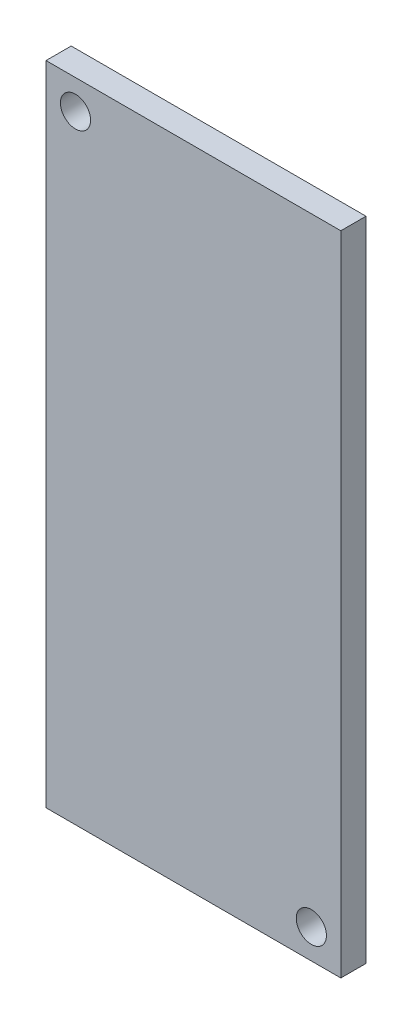
ISO-10303-21;
HEADER;
FILE_DESCRIPTION(('STEP AP214'),'2;1');
FILE_NAME('part.step','',(''),(''),'','','');
FILE_SCHEMA(('AUTOMOTIVE_DESIGN { 1 0 10303 214 1 1 1 1 }'));
ENDSEC;
DATA;
#1=APPLICATION_CONTEXT('core data for automotive mechanical design processes');
#2=APPLICATION_PROTOCOL_DEFINITION('international standard','automotive_design',2000,#1);
#3=PRODUCT_CONTEXT('',#1,'mechanical');
#4=PRODUCT('Part','Part','',(#3));
#5=PRODUCT_RELATED_PRODUCT_CATEGORY('part','',(#4));
#6=PRODUCT_DEFINITION_FORMATION('','',#4);
#7=PRODUCT_DEFINITION_CONTEXT('part definition',#1,'design');
#8=PRODUCT_DEFINITION('design','',#6,#7);
#9=PRODUCT_DEFINITION_SHAPE('','',#8);
#10=(LENGTH_UNIT() NAMED_UNIT(*) SI_UNIT(.MILLI.,.METRE.));
#11=(NAMED_UNIT(*) PLANE_ANGLE_UNIT() SI_UNIT($,.RADIAN.));
#12=(NAMED_UNIT(*) SI_UNIT($,.STERADIAN.) SOLID_ANGLE_UNIT());
#13=UNCERTAINTY_MEASURE_WITH_UNIT(LENGTH_MEASURE(1.E-05),#10,'distance_accuracy_value','');
#14=(GEOMETRIC_REPRESENTATION_CONTEXT(3) GLOBAL_UNCERTAINTY_ASSIGNED_CONTEXT((#13)) GLOBAL_UNIT_ASSIGNED_CONTEXT((#10,
#11,#12)) REPRESENTATION_CONTEXT('',''));
#15=CARTESIAN_POINT('',(0.,0.,0.));
#16=DIRECTION('',(0.,0.,1.));
#17=DIRECTION('',(1.,0.,0.));
#18=AXIS2_PLACEMENT_3D('',#15,#16,#17);
#19=CARTESIAN_POINT('',(-10.25,22.5,1.75));
#20=DIRECTION('',(1.,0.,0.));
#21=DIRECTION('',(0.,0.,-1.));
#22=AXIS2_PLACEMENT_3D('',#19,#20,#21);
#23=PLANE('',#22);
#24=DIRECTION('',(0.,-1.,0.));
#25=VECTOR('',#24,1.);
#26=CARTESIAN_POINT('',(-10.25,22.5,0.));
#27=LINE('',#26,#25);
#28=CARTESIAN_POINT('',(-10.25,22.5,0.));
#29=VERTEX_POINT('',#28);
#30=CARTESIAN_POINT('',(-10.25,-22.5,0.));
#31=VERTEX_POINT('',#30);
#32=EDGE_CURVE('E97',#29,#31,#27,.T.);
#33=ORIENTED_EDGE('',*,*,#32,.T.);
#34=DIRECTION('',(0.,0.,-1.));
#35=VECTOR('',#34,1.);
#36=CARTESIAN_POINT('',(-10.25,-22.5,1.75));
#37=LINE('',#36,#35);
#38=CARTESIAN_POINT('',(-10.25,-22.5,1.75));
#39=VERTEX_POINT('',#38);
#40=EDGE_CURVE('E11',#39,#31,#37,.T.);
#41=ORIENTED_EDGE('',*,*,#40,.F.);
#42=DIRECTION('',(0.,-1.,0.));
#43=VECTOR('',#42,1.);
#44=CARTESIAN_POINT('',(-10.25,22.5,1.75));
#45=LINE('',#44,#43);
#46=CARTESIAN_POINT('',(-10.25,22.5,1.75));
#47=VERTEX_POINT('',#46);
#48=EDGE_CURVE('E85',#47,#39,#45,.T.);
#49=ORIENTED_EDGE('',*,*,#48,.F.);
#50=DIRECTION('',(0.,0.,-1.));
#51=VECTOR('',#50,1.);
#52=CARTESIAN_POINT('',(-10.25,22.5,1.75));
#53=LINE('',#52,#51);
#54=EDGE_CURVE('E93',#47,#29,#53,.T.);
#55=ORIENTED_EDGE('',*,*,#54,.T.);
#56=EDGE_LOOP('',(#33,#41,#49,#55));
#57=FACE_BOUND('',#56,.T.);
#58=ADVANCED_FACE('F34',(#57),#23,.F.);
#59=CARTESIAN_POINT('',(-10.25,-22.5,1.75));
#60=DIRECTION('',(0.,1.,0.));
#61=DIRECTION('',(0.,0.,1.));
#62=AXIS2_PLACEMENT_3D('',#59,#60,#61);
#63=PLANE('',#62);
#64=DIRECTION('',(1.,0.,0.));
#65=VECTOR('',#64,1.);
#66=CARTESIAN_POINT('',(-10.25,-22.5,0.));
#67=LINE('',#66,#65);
#68=CARTESIAN_POINT('',(10.25,-22.5,0.));
#69=VERTEX_POINT('',#68);
#70=EDGE_CURVE('E89',#31,#69,#67,.T.);
#71=ORIENTED_EDGE('',*,*,#70,.T.);
#72=DIRECTION('',(0.,0.,-1.));
#73=VECTOR('',#72,1.);
#74=CARTESIAN_POINT('',(10.25,-22.5,1.75));
#75=LINE('',#74,#73);
#76=CARTESIAN_POINT('',(10.25,-22.5,1.75));
#77=VERTEX_POINT('',#76);
#78=EDGE_CURVE('E42',#77,#69,#75,.T.);
#79=ORIENTED_EDGE('',*,*,#78,.F.);
#80=DIRECTION('',(1.,0.,0.));
#81=VECTOR('',#80,1.);
#82=CARTESIAN_POINT('',(-10.25,-22.5,1.75));
#83=LINE('',#82,#81);
#84=EDGE_CURVE('E80',#39,#77,#83,.T.);
#85=ORIENTED_EDGE('',*,*,#84,.F.);
#86=ORIENTED_EDGE('',*,*,#40,.T.);
#87=EDGE_LOOP('',(#71,#79,#85,#86));
#88=FACE_BOUND('',#87,.T.);
#89=ADVANCED_FACE('F88',(#88),#63,.F.);
#90=CARTESIAN_POINT('',(10.25,22.5,1.75));
#91=DIRECTION('',(-1.,0.,0.));
#92=DIRECTION('',(0.,0.,1.));
#93=AXIS2_PLACEMENT_3D('',#90,#91,#92);
#94=PLANE('',#93);
#95=DIRECTION('',(0.,1.,0.));
#96=VECTOR('',#95,1.);
#97=CARTESIAN_POINT('',(10.25,22.5,0.));
#98=LINE('',#97,#96);
#99=CARTESIAN_POINT('',(10.25,22.5,0.));
#100=VERTEX_POINT('',#99);
#101=EDGE_CURVE('E67',#69,#100,#98,.T.);
#102=ORIENTED_EDGE('',*,*,#101,.T.);
#103=DIRECTION('',(0.,0.,-1.));
#104=VECTOR('',#103,1.);
#105=CARTESIAN_POINT('',(10.25,22.5,1.75));
#106=LINE('',#105,#104);
#107=CARTESIAN_POINT('',(10.25,22.5,1.75));
#108=VERTEX_POINT('',#107);
#109=EDGE_CURVE('E90',#108,#100,#106,.T.);
#110=ORIENTED_EDGE('',*,*,#109,.F.);
#111=DIRECTION('',(0.,1.,0.));
#112=VECTOR('',#111,1.);
#113=CARTESIAN_POINT('',(10.25,22.5,1.75));
#114=LINE('',#113,#112);
#115=EDGE_CURVE('E83',#77,#108,#114,.T.);
#116=ORIENTED_EDGE('',*,*,#115,.F.);
#117=ORIENTED_EDGE('',*,*,#78,.T.);
#118=EDGE_LOOP('',(#102,#110,#116,#117));
#119=FACE_BOUND('',#118,.T.);
#120=ADVANCED_FACE('F91',(#119),#94,.F.);
#121=CARTESIAN_POINT('',(-10.25,22.5,1.75));
#122=DIRECTION('',(0.,-1.,0.));
#123=DIRECTION('',(0.,0.,-1.));
#124=AXIS2_PLACEMENT_3D('',#121,#122,#123);
#125=PLANE('',#124);
#126=DIRECTION('',(-1.,0.,0.));
#127=VECTOR('',#126,1.);
#128=CARTESIAN_POINT('',(-10.25,22.5,0.));
#129=LINE('',#128,#127);
#130=EDGE_CURVE('E73',#100,#29,#129,.T.);
#131=ORIENTED_EDGE('',*,*,#130,.T.);
#132=ORIENTED_EDGE('',*,*,#54,.F.);
#133=DIRECTION('',(-1.,0.,0.));
#134=VECTOR('',#133,1.);
#135=CARTESIAN_POINT('',(-10.25,22.5,1.75));
#136=LINE('',#135,#134);
#137=EDGE_CURVE('E50',#108,#47,#136,.T.);
#138=ORIENTED_EDGE('',*,*,#137,.F.);
#139=ORIENTED_EDGE('',*,*,#109,.T.);
#140=EDGE_LOOP('',(#131,#132,#138,#139));
#141=FACE_BOUND('',#140,.T.);
#142=ADVANCED_FACE('F105',(#141),#125,.F.);
#143=CARTESIAN_POINT('',(-10.25,-22.5,1.75));
#144=DIRECTION('',(0.,0.,1.));
#145=DIRECTION('',(1.,0.,0.));
#146=AXIS2_PLACEMENT_3D('',#143,#144,#145);
#147=PLANE('',#146);
#148=CARTESIAN_POINT('',(-8.2,20.45,1.75));
#149=DIRECTION('',(0.,0.,1.));
#150=DIRECTION('',(1.,0.,0.));
#151=AXIS2_PLACEMENT_3D('',#148,#149,#150);
#152=CIRCLE('',#151,1.05);
#153=CARTESIAN_POINT('',(-7.15,20.45,1.75));
#154=VERTEX_POINT('',#153);
#155=EDGE_CURVE('E119',#154,#154,#152,.T.);
#156=ORIENTED_EDGE('',*,*,#155,.F.);
#157=EDGE_LOOP('',(#156));
#158=FACE_BOUND('',#157,.T.);
#159=CARTESIAN_POINT('',(8.2,-20.45,1.75));
#160=DIRECTION('',(0.,0.,1.));
#161=DIRECTION('',(1.,0.,0.));
#162=AXIS2_PLACEMENT_3D('',#159,#160,#161);
#163=CIRCLE('',#162,1.05);
#164=CARTESIAN_POINT('',(9.25,-20.45,1.75));
#165=VERTEX_POINT('',#164);
#166=EDGE_CURVE('E113',#165,#165,#163,.T.);
#167=ORIENTED_EDGE('',*,*,#166,.F.);
#168=EDGE_LOOP('',(#167));
#169=FACE_BOUND('',#168,.T.);
#170=ORIENTED_EDGE('',*,*,#48,.T.);
#171=ORIENTED_EDGE('',*,*,#84,.T.);
#172=ORIENTED_EDGE('',*,*,#115,.T.);
#173=ORIENTED_EDGE('',*,*,#137,.T.);
#174=EDGE_LOOP('',(#170,#171,#172,#173));
#175=FACE_BOUND('',#174,.T.);
#176=ADVANCED_FACE('F81',(#158,#169,#175),#147,.T.);
#177=CARTESIAN_POINT('',(-10.25,-22.5,0.));
#178=DIRECTION('',(0.,0.,1.));
#179=DIRECTION('',(1.,0.,0.));
#180=AXIS2_PLACEMENT_3D('',#177,#178,#179);
#181=PLANE('',#180);
#182=CARTESIAN_POINT('',(-8.2,20.45,0.));
#183=DIRECTION('',(0.,0.,1.));
#184=DIRECTION('',(1.,0.,0.));
#185=AXIS2_PLACEMENT_3D('',#182,#183,#184);
#186=CIRCLE('',#185,1.05);
#187=CARTESIAN_POINT('',(-7.15,20.45,0.));
#188=VERTEX_POINT('',#187);
#189=EDGE_CURVE('E116',#188,#188,#186,.F.);
#190=ORIENTED_EDGE('',*,*,#189,.F.);
#191=EDGE_LOOP('',(#190));
#192=FACE_BOUND('',#191,.T.);
#193=CARTESIAN_POINT('',(8.2,-20.45,0.));
#194=DIRECTION('',(0.,0.,1.));
#195=DIRECTION('',(1.,0.,0.));
#196=AXIS2_PLACEMENT_3D('',#193,#194,#195);
#197=CIRCLE('',#196,1.05);
#198=CARTESIAN_POINT('',(9.25,-20.45,0.));
#199=VERTEX_POINT('',#198);
#200=EDGE_CURVE('E100',#199,#199,#197,.F.);
#201=ORIENTED_EDGE('',*,*,#200,.F.);
#202=EDGE_LOOP('',(#201));
#203=FACE_BOUND('',#202,.T.);
#204=ORIENTED_EDGE('',*,*,#32,.F.);
#205=ORIENTED_EDGE('',*,*,#130,.F.);
#206=ORIENTED_EDGE('',*,*,#101,.F.);
#207=ORIENTED_EDGE('',*,*,#70,.F.);
#208=EDGE_LOOP('',(#204,#205,#206,#207));
#209=FACE_BOUND('',#208,.T.);
#210=ADVANCED_FACE('F108',(#192,#203,#209),#181,.F.);
#211=CARTESIAN_POINT('',(8.2,-20.45,-2.9698484809835));
#212=DIRECTION('',(0.,0.,1.));
#213=DIRECTION('',(1.,0.,0.));
#214=AXIS2_PLACEMENT_3D('',#211,#212,#213);
#215=CYLINDRICAL_SURFACE('',#214,1.05);
#216=ORIENTED_EDGE('',*,*,#200,.T.);
#217=EDGE_LOOP('',(#216));
#218=FACE_BOUND('',#217,.T.);
#219=ORIENTED_EDGE('',*,*,#166,.T.);
#220=EDGE_LOOP('',(#219));
#221=FACE_BOUND('',#220,.T.);
#222=ADVANCED_FACE('F130',(#218,#221),#215,.F.);
#223=CARTESIAN_POINT('',(-8.2,20.45,-2.9698484809835));
#224=DIRECTION('',(0.,0.,1.));
#225=DIRECTION('',(1.,0.,0.));
#226=AXIS2_PLACEMENT_3D('',#223,#224,#225);
#227=CYLINDRICAL_SURFACE('',#226,1.05);
#228=ORIENTED_EDGE('',*,*,#189,.T.);
#229=EDGE_LOOP('',(#228));
#230=FACE_BOUND('',#229,.T.);
#231=ORIENTED_EDGE('',*,*,#155,.T.);
#232=EDGE_LOOP('',(#231));
#233=FACE_BOUND('',#232,.T.);
#234=ADVANCED_FACE('F123',(#230,#233),#227,.F.);
#235=CLOSED_SHELL('',(#58,#89,#120,#142,#176,#210,#222,#234));
#236=MANIFOLD_SOLID_BREP('B2',#235);
#237=ADVANCED_BREP_SHAPE_REPRESENTATION('',(#18,#236),#14);
#238=SHAPE_DEFINITION_REPRESENTATION(#9,#237);
ENDSEC;
END-ISO-10303-21;
